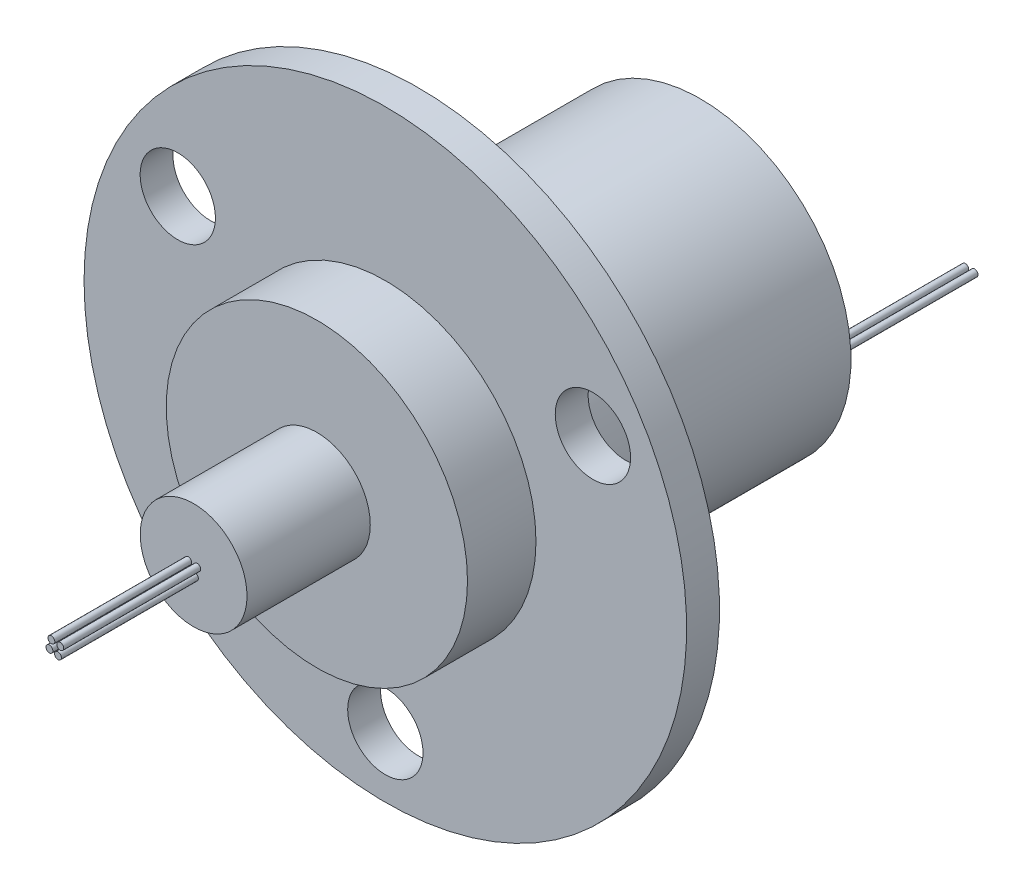
ISO-10303-21;
HEADER;
FILE_DESCRIPTION(('STEP AP214'),'2;1');
FILE_NAME('part.step','',(''),(''),'','','');
FILE_SCHEMA(('AUTOMOTIVE_DESIGN { 1 0 10303 214 1 1 1 1 }'));
ENDSEC;
DATA;
#1=APPLICATION_CONTEXT('core data for automotive mechanical design processes');
#2=APPLICATION_PROTOCOL_DEFINITION('international standard','automotive_design',2000,#1);
#3=PRODUCT_CONTEXT('',#1,'mechanical');
#4=PRODUCT('Part','Part','',(#3));
#5=PRODUCT_RELATED_PRODUCT_CATEGORY('part','',(#4));
#6=PRODUCT_DEFINITION_FORMATION('','',#4);
#7=PRODUCT_DEFINITION_CONTEXT('part definition',#1,'design');
#8=PRODUCT_DEFINITION('design','',#6,#7);
#9=PRODUCT_DEFINITION_SHAPE('','',#8);
#10=(LENGTH_UNIT() NAMED_UNIT(*) SI_UNIT(.MILLI.,.METRE.));
#11=(NAMED_UNIT(*) PLANE_ANGLE_UNIT() SI_UNIT($,.RADIAN.));
#12=(NAMED_UNIT(*) SI_UNIT($,.STERADIAN.) SOLID_ANGLE_UNIT());
#13=UNCERTAINTY_MEASURE_WITH_UNIT(LENGTH_MEASURE(1.E-05),#10,'distance_accuracy_value','');
#14=(GEOMETRIC_REPRESENTATION_CONTEXT(3) GLOBAL_UNCERTAINTY_ASSIGNED_CONTEXT((#13)) GLOBAL_UNIT_ASSIGNED_CONTEXT((#10,
#11,#12)) REPRESENTATION_CONTEXT('',''));
#15=CARTESIAN_POINT('',(0.,0.,0.));
#16=DIRECTION('',(0.,0.,1.));
#17=DIRECTION('',(1.,0.,0.));
#18=AXIS2_PLACEMENT_3D('',#15,#16,#17);
#19=CARTESIAN_POINT('',(0.,0.,0.));
#20=DIRECTION('',(0.,0.,-1.));
#21=DIRECTION('',(-1.,0.,0.));
#22=AXIS2_PLACEMENT_3D('',#19,#20,#21);
#23=PLANE('',#22);
#24=CARTESIAN_POINT('',(15.1554445662278,8.74999999999986,0.));
#25=DIRECTION('',(0.,0.,-1.));
#26=DIRECTION('',(-1.,0.,0.));
#27=AXIS2_PLACEMENT_3D('',#24,#25,#26);
#28=CIRCLE('',#27,2.74999999999998);
#29=CARTESIAN_POINT('',(12.4054445662278,8.74999999999986,0.));
#30=VERTEX_POINT('',#29);
#31=EDGE_CURVE('E66',#30,#30,#28,.T.);
#32=ORIENTED_EDGE('',*,*,#31,.F.);
#33=EDGE_LOOP('',(#32));
#34=FACE_BOUND('',#33,.T.);
#35=CARTESIAN_POINT('',(-15.1554445662276,8.75000000000007,0.));
#36=DIRECTION('',(0.,0.,-1.));
#37=DIRECTION('',(-1.,0.,0.));
#38=AXIS2_PLACEMENT_3D('',#35,#36,#37);
#39=CIRCLE('',#38,2.74999999999998);
#40=CARTESIAN_POINT('',(-17.9054445662276,8.75000000000007,0.));
#41=VERTEX_POINT('',#40);
#42=EDGE_CURVE('E56',#41,#41,#39,.T.);
#43=ORIENTED_EDGE('',*,*,#42,.F.);
#44=EDGE_LOOP('',(#43));
#45=FACE_BOUND('',#44,.T.);
#46=CARTESIAN_POINT('',(0.,-17.5,0.));
#47=DIRECTION('',(0.,0.,-1.));
#48=DIRECTION('',(-1.,0.,0.));
#49=AXIS2_PLACEMENT_3D('',#46,#47,#48);
#50=CIRCLE('',#49,2.74999999999998);
#51=CARTESIAN_POINT('',(-2.74999999999998,-17.5,0.));
#52=VERTEX_POINT('',#51);
#53=EDGE_CURVE('E53',#52,#52,#50,.T.);
#54=ORIENTED_EDGE('',*,*,#53,.F.);
#55=EDGE_LOOP('',(#54));
#56=FACE_BOUND('',#55,.T.);
#57=CARTESIAN_POINT('',(0.,0.,0.));
#58=DIRECTION('',(0.,0.,-1.));
#59=DIRECTION('',(-1.,0.,0.));
#60=AXIS2_PLACEMENT_3D('',#57,#58,#59);
#61=CIRCLE('',#60,22.);
#62=CARTESIAN_POINT('',(-22.,0.,0.));
#63=VERTEX_POINT('',#62);
#64=EDGE_CURVE('E108',#63,#63,#61,.T.);
#65=ORIENTED_EDGE('',*,*,#64,.T.);
#66=EDGE_LOOP('',(#65));
#67=FACE_BOUND('',#66,.T.);
#68=CARTESIAN_POINT('',(0.,0.,0.));
#69=DIRECTION('',(0.,0.,-1.));
#70=DIRECTION('',(-1.,0.,0.));
#71=AXIS2_PLACEMENT_3D('',#68,#69,#70);
#72=CIRCLE('',#71,11.);
#73=CARTESIAN_POINT('',(-11.,0.,0.));
#74=VERTEX_POINT('',#73);
#75=EDGE_CURVE('E92',#74,#74,#72,.T.);
#76=ORIENTED_EDGE('',*,*,#75,.F.);
#77=EDGE_LOOP('',(#76));
#78=FACE_BOUND('',#77,.T.);
#79=ADVANCED_FACE('F33',(#34,#45,#56,#67,#78),#23,.T.);
#80=CARTESIAN_POINT('',(0.,0.,7.4));
#81=DIRECTION('',(0.,0.,1.));
#82=DIRECTION('',(1.,0.,0.));
#83=AXIS2_PLACEMENT_3D('',#80,#81,#82);
#84=PLANE('',#83);
#85=CARTESIAN_POINT('',(0.,0.,7.4));
#86=DIRECTION('',(0.,0.,1.));
#87=DIRECTION('',(1.,0.,0.));
#88=AXIS2_PLACEMENT_3D('',#85,#86,#87);
#89=CIRCLE('',#88,11.);
#90=CARTESIAN_POINT('',(11.,0.,7.4));
#91=VERTEX_POINT('',#90);
#92=EDGE_CURVE('E105',#91,#91,#89,.T.);
#93=ORIENTED_EDGE('',*,*,#92,.T.);
#94=EDGE_LOOP('',(#93));
#95=FACE_BOUND('',#94,.T.);
#96=CARTESIAN_POINT('',(0.,0.,7.4));
#97=DIRECTION('',(0.,0.,1.));
#98=DIRECTION('',(1.,0.,0.));
#99=AXIS2_PLACEMENT_3D('',#96,#97,#98);
#100=CIRCLE('',#99,3.9);
#101=CARTESIAN_POINT('',(3.9,0.,7.4));
#102=VERTEX_POINT('',#101);
#103=EDGE_CURVE('E96',#102,#102,#100,.T.);
#104=ORIENTED_EDGE('',*,*,#103,.F.);
#105=EDGE_LOOP('',(#104));
#106=FACE_BOUND('',#105,.T.);
#107=ADVANCED_FACE('F155',(#95,#106),#84,.T.);
#108=CARTESIAN_POINT('',(22.,0.,2.4));
#109=DIRECTION('',(0.,0.,1.));
#110=DIRECTION('',(1.,0.,0.));
#111=AXIS2_PLACEMENT_3D('',#108,#109,#110);
#112=PLANE('',#111);
#113=CARTESIAN_POINT('',(15.1554445662278,8.74999999999986,2.4));
#114=DIRECTION('',(0.,0.,1.));
#115=DIRECTION('',(1.,0.,0.));
#116=AXIS2_PLACEMENT_3D('',#113,#114,#115);
#117=CIRCLE('',#116,2.74999999999998);
#118=CARTESIAN_POINT('',(17.9054445662277,8.74999999999986,2.4));
#119=VERTEX_POINT('',#118);
#120=EDGE_CURVE('E37',#119,#119,#117,.T.);
#121=ORIENTED_EDGE('',*,*,#120,.F.);
#122=EDGE_LOOP('',(#121));
#123=FACE_BOUND('',#122,.T.);
#124=CARTESIAN_POINT('',(-15.1554445662276,8.75000000000007,2.4));
#125=DIRECTION('',(0.,0.,1.));
#126=DIRECTION('',(1.,0.,0.));
#127=AXIS2_PLACEMENT_3D('',#124,#125,#126);
#128=CIRCLE('',#127,2.74999999999998);
#129=CARTESIAN_POINT('',(-12.4054445662277,8.75000000000007,2.4));
#130=VERTEX_POINT('',#129);
#131=EDGE_CURVE('E54',#130,#130,#128,.T.);
#132=ORIENTED_EDGE('',*,*,#131,.F.);
#133=EDGE_LOOP('',(#132));
#134=FACE_BOUND('',#133,.T.);
#135=CARTESIAN_POINT('',(0.,-17.5,2.4));
#136=DIRECTION('',(0.,0.,1.));
#137=DIRECTION('',(1.,0.,0.));
#138=AXIS2_PLACEMENT_3D('',#135,#136,#137);
#139=CIRCLE('',#138,2.74999999999998);
#140=CARTESIAN_POINT('',(2.74999999999998,-17.5,2.4));
#141=VERTEX_POINT('',#140);
#142=EDGE_CURVE('E50',#141,#141,#139,.T.);
#143=ORIENTED_EDGE('',*,*,#142,.F.);
#144=EDGE_LOOP('',(#143));
#145=FACE_BOUND('',#144,.T.);
#146=CARTESIAN_POINT('',(0.,0.,2.4));
#147=DIRECTION('',(0.,0.,-1.));
#148=DIRECTION('',(-1.,0.,0.));
#149=AXIS2_PLACEMENT_3D('',#146,#147,#148);
#150=CIRCLE('',#149,22.);
#151=CARTESIAN_POINT('',(-22.,0.,2.4));
#152=VERTEX_POINT('',#151);
#153=EDGE_CURVE('E113',#152,#152,#150,.T.);
#154=ORIENTED_EDGE('',*,*,#153,.F.);
#155=EDGE_LOOP('',(#154));
#156=FACE_BOUND('',#155,.T.);
#157=CARTESIAN_POINT('',(0.,0.,2.4));
#158=DIRECTION('',(0.,0.,1.));
#159=DIRECTION('',(1.,0.,0.));
#160=AXIS2_PLACEMENT_3D('',#157,#158,#159);
#161=CIRCLE('',#160,11.);
#162=CARTESIAN_POINT('',(11.,0.,2.4));
#163=VERTEX_POINT('',#162);
#164=EDGE_CURVE('E102',#163,#163,#161,.T.);
#165=ORIENTED_EDGE('',*,*,#164,.F.);
#166=EDGE_LOOP('',(#165));
#167=FACE_BOUND('',#166,.T.);
#168=ADVANCED_FACE('F161',(#123,#134,#145,#156,#167),#112,.T.);
#169=CARTESIAN_POINT('',(0.,0.,2.4));
#170=DIRECTION('',(0.,0.,-1.));
#171=DIRECTION('',(-1.,0.,0.));
#172=AXIS2_PLACEMENT_3D('',#169,#170,#171);
#173=CYLINDRICAL_SURFACE('',#172,22.);
#174=ORIENTED_EDGE('',*,*,#153,.T.);
#175=EDGE_LOOP('',(#174));
#176=FACE_BOUND('',#175,.T.);
#177=ORIENTED_EDGE('',*,*,#64,.F.);
#178=EDGE_LOOP('',(#177));
#179=FACE_BOUND('',#178,.T.);
#180=ADVANCED_FACE('F35',(#176,#179),#173,.T.);
#181=CARTESIAN_POINT('',(0.,0.,7.4));
#182=DIRECTION('',(0.,0.,-1.));
#183=DIRECTION('',(-1.,0.,0.));
#184=AXIS2_PLACEMENT_3D('',#181,#182,#183);
#185=CYLINDRICAL_SURFACE('',#184,11.);
#186=ORIENTED_EDGE('',*,*,#92,.F.);
#187=EDGE_LOOP('',(#186));
#188=FACE_BOUND('',#187,.T.);
#189=ORIENTED_EDGE('',*,*,#164,.T.);
#190=EDGE_LOOP('',(#189));
#191=FACE_BOUND('',#190,.T.);
#192=ADVANCED_FACE('F167',(#188,#191),#185,.T.);
#193=CARTESIAN_POINT('',(0.,0.,16.4));
#194=DIRECTION('',(0.,0.,-1.));
#195=DIRECTION('',(-1.,0.,0.));
#196=AXIS2_PLACEMENT_3D('',#193,#194,#195);
#197=CYLINDRICAL_SURFACE('',#196,3.9);
#198=CARTESIAN_POINT('',(0.,0.,16.4));
#199=DIRECTION('',(0.,0.,1.));
#200=DIRECTION('',(1.,0.,0.));
#201=AXIS2_PLACEMENT_3D('',#198,#199,#200);
#202=CIRCLE('',#201,3.9);
#203=CARTESIAN_POINT('',(3.9,0.,16.4));
#204=VERTEX_POINT('',#203);
#205=EDGE_CURVE('E99',#204,#204,#202,.T.);
#206=ORIENTED_EDGE('',*,*,#205,.F.);
#207=EDGE_LOOP('',(#206));
#208=FACE_BOUND('',#207,.T.);
#209=ORIENTED_EDGE('',*,*,#103,.T.);
#210=EDGE_LOOP('',(#209));
#211=FACE_BOUND('',#210,.T.);
#212=ADVANCED_FACE('F184',(#208,#211),#197,.T.);
#213=CARTESIAN_POINT('',(0.,0.,16.4));
#214=DIRECTION('',(0.,0.,1.));
#215=DIRECTION('',(1.,0.,0.));
#216=AXIS2_PLACEMENT_3D('',#213,#214,#215);
#217=PLANE('',#216);
#218=CARTESIAN_POINT('',(0.263776295341245,0.,16.4));
#219=DIRECTION('',(0.,0.,1.));
#220=DIRECTION('',(1.,0.,0.));
#221=AXIS2_PLACEMENT_3D('',#218,#219,#220);
#222=CIRCLE('',#221,0.25);
#223=CARTESIAN_POINT('',(0.513776295341245,0.,16.4));
#224=VERTEX_POINT('',#223);
#225=EDGE_CURVE('E10',#224,#224,#222,.T.);
#226=ORIENTED_EDGE('',*,*,#225,.F.);
#227=EDGE_LOOP('',(#226));
#228=FACE_BOUND('',#227,.T.);
#229=CARTESIAN_POINT('',(-0.527355811641428,-0.562471216596805,16.4));
#230=DIRECTION('',(0.,0.,1.));
#231=DIRECTION('',(1.,0.,0.));
#232=AXIS2_PLACEMENT_3D('',#229,#230,#231);
#233=CIRCLE('',#232,0.25);
#234=CARTESIAN_POINT('',(-0.277355811641428,-0.562471216596805,16.4));
#235=VERTEX_POINT('',#234);
#236=EDGE_CURVE('E122',#235,#235,#233,.T.);
#237=ORIENTED_EDGE('',*,*,#236,.F.);
#238=EDGE_LOOP('',(#237));
#239=FACE_BOUND('',#238,.T.);
#240=CARTESIAN_POINT('',(-0.38516931155641,0.0911610825937714,16.4));
#241=DIRECTION('',(0.,0.,1.));
#242=DIRECTION('',(1.,0.,0.));
#243=AXIS2_PLACEMENT_3D('',#240,#241,#242);
#244=CIRCLE('',#243,0.25);
#245=CARTESIAN_POINT('',(-0.13516931155641,0.0911610825937714,16.4));
#246=VERTEX_POINT('',#245);
#247=EDGE_CURVE('E119',#246,#246,#244,.T.);
#248=ORIENTED_EDGE('',*,*,#247,.F.);
#249=EDGE_LOOP('',(#248));
#250=FACE_BOUND('',#249,.T.);
#251=CARTESIAN_POINT('',(0.0981194299924937,-0.675788748253581,16.4));
#252=DIRECTION('',(0.,0.,1.));
#253=DIRECTION('',(1.,0.,0.));
#254=AXIS2_PLACEMENT_3D('',#251,#252,#253);
#255=CIRCLE('',#254,0.25);
#256=CARTESIAN_POINT('',(0.348119429992494,-0.675788748253581,16.4));
#257=VERTEX_POINT('',#256);
#258=EDGE_CURVE('E116',#257,#257,#255,.T.);
#259=ORIENTED_EDGE('',*,*,#258,.F.);
#260=EDGE_LOOP('',(#259));
#261=FACE_BOUND('',#260,.T.);
#262=ORIENTED_EDGE('',*,*,#205,.T.);
#263=EDGE_LOOP('',(#262));
#264=FACE_BOUND('',#263,.T.);
#265=ADVANCED_FACE('F150',(#228,#239,#250,#261,#264),#217,.T.);
#266=CARTESIAN_POINT('',(0.,0.,-20.6));
#267=DIRECTION('',(0.,0.,1.));
#268=DIRECTION('',(1.,0.,0.));
#269=AXIS2_PLACEMENT_3D('',#266,#267,#268);
#270=CYLINDRICAL_SURFACE('',#269,11.);
#271=CARTESIAN_POINT('',(0.,0.,-20.6));
#272=DIRECTION('',(0.,0.,-1.));
#273=DIRECTION('',(-1.,0.,0.));
#274=AXIS2_PLACEMENT_3D('',#271,#272,#273);
#275=CIRCLE('',#274,11.);
#276=CARTESIAN_POINT('',(-11.,0.,-20.6));
#277=VERTEX_POINT('',#276);
#278=EDGE_CURVE('E93',#277,#277,#275,.T.);
#279=ORIENTED_EDGE('',*,*,#278,.F.);
#280=EDGE_LOOP('',(#279));
#281=FACE_BOUND('',#280,.T.);
#282=ORIENTED_EDGE('',*,*,#75,.T.);
#283=EDGE_LOOP('',(#282));
#284=FACE_BOUND('',#283,.T.);
#285=ADVANCED_FACE('F139',(#281,#284),#270,.T.);
#286=CARTESIAN_POINT('',(0.,0.,-20.6));
#287=DIRECTION('',(0.,0.,-1.));
#288=DIRECTION('',(-1.,0.,0.));
#289=AXIS2_PLACEMENT_3D('',#286,#287,#288);
#290=PLANE('',#289);
#291=CARTESIAN_POINT('',(-10.102336314438,0.,-20.6));
#292=DIRECTION('',(0.,0.,-1.));
#293=DIRECTION('',(-1.,0.,0.));
#294=AXIS2_PLACEMENT_3D('',#291,#292,#293);
#295=CIRCLE('',#294,0.25);
#296=CARTESIAN_POINT('',(-10.352336314438,0.,-20.6));
#297=VERTEX_POINT('',#296);
#298=EDGE_CURVE('E41',#297,#297,#295,.T.);
#299=ORIENTED_EDGE('',*,*,#298,.F.);
#300=EDGE_LOOP('',(#299));
#301=FACE_BOUND('',#300,.T.);
#302=CARTESIAN_POINT('',(9.34429353671362,0.,-20.6));
#303=DIRECTION('',(0.,0.,-1.));
#304=DIRECTION('',(-1.,0.,0.));
#305=AXIS2_PLACEMENT_3D('',#302,#303,#304);
#306=CIRCLE('',#305,0.25);
#307=CARTESIAN_POINT('',(9.09429353671362,0.,-20.6));
#308=VERTEX_POINT('',#307);
#309=EDGE_CURVE('E46',#308,#308,#306,.T.);
#310=ORIENTED_EDGE('',*,*,#309,.F.);
#311=EDGE_LOOP('',(#310));
#312=FACE_BOUND('',#311,.T.);
#313=CARTESIAN_POINT('',(10.0241698032389,0.,-20.6));
#314=DIRECTION('',(0.,0.,-1.));
#315=DIRECTION('',(-1.,0.,0.));
#316=AXIS2_PLACEMENT_3D('',#313,#314,#315);
#317=CIRCLE('',#316,0.25);
#318=CARTESIAN_POINT('',(9.77416980323892,0.,-20.6));
#319=VERTEX_POINT('',#318);
#320=EDGE_CURVE('E128',#319,#319,#317,.T.);
#321=ORIENTED_EDGE('',*,*,#320,.F.);
#322=EDGE_LOOP('',(#321));
#323=FACE_BOUND('',#322,.T.);
#324=CARTESIAN_POINT('',(-9.26391296849852,0.,-20.6));
#325=DIRECTION('',(0.,0.,-1.));
#326=DIRECTION('',(-1.,0.,0.));
#327=AXIS2_PLACEMENT_3D('',#324,#325,#326);
#328=CIRCLE('',#327,0.25);
#329=CARTESIAN_POINT('',(-9.51391296849852,0.,-20.6));
#330=VERTEX_POINT('',#329);
#331=EDGE_CURVE('E125',#330,#330,#328,.T.);
#332=ORIENTED_EDGE('',*,*,#331,.F.);
#333=EDGE_LOOP('',(#332));
#334=FACE_BOUND('',#333,.T.);
#335=ORIENTED_EDGE('',*,*,#278,.T.);
#336=EDGE_LOOP('',(#335));
#337=FACE_BOUND('',#336,.T.);
#338=ADVANCED_FACE('F135',(#301,#312,#323,#334,#337),#290,.T.);
#339=CARTESIAN_POINT('',(0.0981194299924937,-0.675788748253581,26.4));
#340=DIRECTION('',(0.,0.,-1.));
#341=DIRECTION('',(-1.,0.,0.));
#342=AXIS2_PLACEMENT_3D('',#339,#340,#341);
#343=CYLINDRICAL_SURFACE('',#342,0.25);
#344=CARTESIAN_POINT('',(0.0981194299924937,-0.675788748253581,26.4));
#345=DIRECTION('',(0.,0.,-1.));
#346=DIRECTION('',(-1.,0.,0.));
#347=AXIS2_PLACEMENT_3D('',#344,#345,#346);
#348=CIRCLE('',#347,0.25);
#349=CARTESIAN_POINT('',(-0.151880570007506,-0.675788748253581,26.4));
#350=VERTEX_POINT('',#349);
#351=EDGE_CURVE('E89',#350,#350,#348,.T.);
#352=ORIENTED_EDGE('',*,*,#351,.T.);
#353=EDGE_LOOP('',(#352));
#354=FACE_BOUND('',#353,.T.);
#355=ORIENTED_EDGE('',*,*,#258,.T.);
#356=EDGE_LOOP('',(#355));
#357=FACE_BOUND('',#356,.T.);
#358=ADVANCED_FACE('F138',(#354,#357),#343,.T.);
#359=CARTESIAN_POINT('',(0.348119429992494,-0.675788748253581,26.4));
#360=DIRECTION('',(0.,0.,1.));
#361=DIRECTION('',(1.,0.,0.));
#362=AXIS2_PLACEMENT_3D('',#359,#360,#361);
#363=PLANE('',#362);
#364=ORIENTED_EDGE('',*,*,#351,.F.);
#365=EDGE_LOOP('',(#364));
#366=FACE_BOUND('',#365,.T.);
#367=ADVANCED_FACE('F204',(#366),#363,.T.);
#368=CARTESIAN_POINT('',(-0.38516931155641,0.0911610825937714,26.4));
#369=DIRECTION('',(0.,0.,-1.));
#370=DIRECTION('',(-1.,0.,0.));
#371=AXIS2_PLACEMENT_3D('',#368,#369,#370);
#372=CYLINDRICAL_SURFACE('',#371,0.25);
#373=CARTESIAN_POINT('',(-0.38516931155641,0.0911610825937714,26.4));
#374=DIRECTION('',(0.,0.,-1.));
#375=DIRECTION('',(-1.,0.,0.));
#376=AXIS2_PLACEMENT_3D('',#373,#374,#375);
#377=CIRCLE('',#376,0.25);
#378=CARTESIAN_POINT('',(-0.63516931155641,0.0911610825937714,26.4));
#379=VERTEX_POINT('',#378);
#380=EDGE_CURVE('E86',#379,#379,#377,.T.);
#381=ORIENTED_EDGE('',*,*,#380,.T.);
#382=EDGE_LOOP('',(#381));
#383=FACE_BOUND('',#382,.T.);
#384=ORIENTED_EDGE('',*,*,#247,.T.);
#385=EDGE_LOOP('',(#384));
#386=FACE_BOUND('',#385,.T.);
#387=ADVANCED_FACE('F208',(#383,#386),#372,.T.);
#388=CARTESIAN_POINT('',(-0.13516931155641,0.0911610825937714,26.4));
#389=DIRECTION('',(0.,0.,1.));
#390=DIRECTION('',(1.,0.,0.));
#391=AXIS2_PLACEMENT_3D('',#388,#389,#390);
#392=PLANE('',#391);
#393=ORIENTED_EDGE('',*,*,#380,.F.);
#394=EDGE_LOOP('',(#393));
#395=FACE_BOUND('',#394,.T.);
#396=ADVANCED_FACE('F212',(#395),#392,.T.);
#397=CARTESIAN_POINT('',(-0.527355811641428,-0.562471216596805,26.4));
#398=DIRECTION('',(0.,0.,-1.));
#399=DIRECTION('',(-1.,0.,0.));
#400=AXIS2_PLACEMENT_3D('',#397,#398,#399);
#401=CYLINDRICAL_SURFACE('',#400,0.25);
#402=CARTESIAN_POINT('',(-0.527355811641428,-0.562471216596805,26.4));
#403=DIRECTION('',(0.,0.,-1.));
#404=DIRECTION('',(-1.,0.,0.));
#405=AXIS2_PLACEMENT_3D('',#402,#403,#404);
#406=CIRCLE('',#405,0.25);
#407=CARTESIAN_POINT('',(-0.777355811641428,-0.562471216596805,26.4));
#408=VERTEX_POINT('',#407);
#409=EDGE_CURVE('E83',#408,#408,#406,.T.);
#410=ORIENTED_EDGE('',*,*,#409,.T.);
#411=EDGE_LOOP('',(#410));
#412=FACE_BOUND('',#411,.T.);
#413=ORIENTED_EDGE('',*,*,#236,.T.);
#414=EDGE_LOOP('',(#413));
#415=FACE_BOUND('',#414,.T.);
#416=ADVANCED_FACE('F216',(#412,#415),#401,.T.);
#417=CARTESIAN_POINT('',(-0.277355811641428,-0.562471216596805,26.4));
#418=DIRECTION('',(0.,0.,1.));
#419=DIRECTION('',(1.,0.,0.));
#420=AXIS2_PLACEMENT_3D('',#417,#418,#419);
#421=PLANE('',#420);
#422=ORIENTED_EDGE('',*,*,#409,.F.);
#423=EDGE_LOOP('',(#422));
#424=FACE_BOUND('',#423,.T.);
#425=ADVANCED_FACE('F220',(#424),#421,.T.);
#426=CARTESIAN_POINT('',(-9.26391296849852,0.,-30.6));
#427=DIRECTION('',(0.,0.,1.));
#428=DIRECTION('',(1.,0.,0.));
#429=AXIS2_PLACEMENT_3D('',#426,#427,#428);
#430=CYLINDRICAL_SURFACE('',#429,0.25);
#431=CARTESIAN_POINT('',(-9.26391296849852,0.,-30.6));
#432=DIRECTION('',(0.,0.,1.));
#433=DIRECTION('',(1.,0.,0.));
#434=AXIS2_PLACEMENT_3D('',#431,#432,#433);
#435=CIRCLE('',#434,0.25);
#436=CARTESIAN_POINT('',(-9.01391296849852,0.,-30.6));
#437=VERTEX_POINT('',#436);
#438=EDGE_CURVE('E80',#437,#437,#435,.T.);
#439=ORIENTED_EDGE('',*,*,#438,.T.);
#440=EDGE_LOOP('',(#439));
#441=FACE_BOUND('',#440,.T.);
#442=ORIENTED_EDGE('',*,*,#331,.T.);
#443=EDGE_LOOP('',(#442));
#444=FACE_BOUND('',#443,.T.);
#445=ADVANCED_FACE('F224',(#441,#444),#430,.T.);
#446=CARTESIAN_POINT('',(-9.01391296849852,0.,-30.6));
#447=DIRECTION('',(0.,0.,-1.));
#448=DIRECTION('',(-1.,0.,0.));
#449=AXIS2_PLACEMENT_3D('',#446,#447,#448);
#450=PLANE('',#449);
#451=ORIENTED_EDGE('',*,*,#438,.F.);
#452=EDGE_LOOP('',(#451));
#453=FACE_BOUND('',#452,.T.);
#454=ADVANCED_FACE('F228',(#453),#450,.T.);
#455=CARTESIAN_POINT('',(10.0241698032389,0.,-30.6));
#456=DIRECTION('',(0.,0.,1.));
#457=DIRECTION('',(1.,0.,0.));
#458=AXIS2_PLACEMENT_3D('',#455,#456,#457);
#459=CYLINDRICAL_SURFACE('',#458,0.25);
#460=CARTESIAN_POINT('',(10.0241698032389,0.,-30.6));
#461=DIRECTION('',(0.,0.,1.));
#462=DIRECTION('',(1.,0.,0.));
#463=AXIS2_PLACEMENT_3D('',#460,#461,#462);
#464=CIRCLE('',#463,0.25);
#465=CARTESIAN_POINT('',(10.2741698032389,0.,-30.6));
#466=VERTEX_POINT('',#465);
#467=EDGE_CURVE('E77',#466,#466,#464,.T.);
#468=ORIENTED_EDGE('',*,*,#467,.T.);
#469=EDGE_LOOP('',(#468));
#470=FACE_BOUND('',#469,.T.);
#471=ORIENTED_EDGE('',*,*,#320,.T.);
#472=EDGE_LOOP('',(#471));
#473=FACE_BOUND('',#472,.T.);
#474=ADVANCED_FACE('F232',(#470,#473),#459,.T.);
#475=CARTESIAN_POINT('',(10.2741698032389,0.,-30.6));
#476=DIRECTION('',(0.,0.,-1.));
#477=DIRECTION('',(-1.,0.,0.));
#478=AXIS2_PLACEMENT_3D('',#475,#476,#477);
#479=PLANE('',#478);
#480=ORIENTED_EDGE('',*,*,#467,.F.);
#481=EDGE_LOOP('',(#480));
#482=FACE_BOUND('',#481,.T.);
#483=ADVANCED_FACE('F236',(#482),#479,.T.);
#484=CARTESIAN_POINT('',(9.34429353671362,0.,-30.6));
#485=DIRECTION('',(0.,0.,1.));
#486=DIRECTION('',(1.,0.,0.));
#487=AXIS2_PLACEMENT_3D('',#484,#485,#486);
#488=CYLINDRICAL_SURFACE('',#487,0.25);
#489=CARTESIAN_POINT('',(9.34429353671362,0.,-30.6));
#490=DIRECTION('',(0.,0.,1.));
#491=DIRECTION('',(1.,0.,0.));
#492=AXIS2_PLACEMENT_3D('',#489,#490,#491);
#493=CIRCLE('',#492,0.25);
#494=CARTESIAN_POINT('',(9.59429353671362,0.,-30.6));
#495=VERTEX_POINT('',#494);
#496=EDGE_CURVE('E74',#495,#495,#493,.T.);
#497=ORIENTED_EDGE('',*,*,#496,.T.);
#498=EDGE_LOOP('',(#497));
#499=FACE_BOUND('',#498,.T.);
#500=ORIENTED_EDGE('',*,*,#309,.T.);
#501=EDGE_LOOP('',(#500));
#502=FACE_BOUND('',#501,.T.);
#503=ADVANCED_FACE('F133',(#499,#502),#488,.T.);
#504=CARTESIAN_POINT('',(9.59429353671362,0.,-30.6));
#505=DIRECTION('',(0.,0.,-1.));
#506=DIRECTION('',(-1.,0.,0.));
#507=AXIS2_PLACEMENT_3D('',#504,#505,#506);
#508=PLANE('',#507);
#509=ORIENTED_EDGE('',*,*,#496,.F.);
#510=EDGE_LOOP('',(#509));
#511=FACE_BOUND('',#510,.T.);
#512=ADVANCED_FACE('F243',(#511),#508,.T.);
#513=CARTESIAN_POINT('',(-10.102336314438,0.,-30.6));
#514=DIRECTION('',(0.,0.,1.));
#515=DIRECTION('',(1.,0.,0.));
#516=AXIS2_PLACEMENT_3D('',#513,#514,#515);
#517=CYLINDRICAL_SURFACE('',#516,0.25);
#518=CARTESIAN_POINT('',(-10.102336314438,0.,-30.6));
#519=DIRECTION('',(0.,0.,1.));
#520=DIRECTION('',(1.,0.,0.));
#521=AXIS2_PLACEMENT_3D('',#518,#519,#520);
#522=CIRCLE('',#521,0.25);
#523=CARTESIAN_POINT('',(-9.85233631443805,0.,-30.6));
#524=VERTEX_POINT('',#523);
#525=EDGE_CURVE('E71',#524,#524,#522,.T.);
#526=ORIENTED_EDGE('',*,*,#525,.T.);
#527=EDGE_LOOP('',(#526));
#528=FACE_BOUND('',#527,.T.);
#529=ORIENTED_EDGE('',*,*,#298,.T.);
#530=EDGE_LOOP('',(#529));
#531=FACE_BOUND('',#530,.T.);
#532=ADVANCED_FACE('F247',(#528,#531),#517,.T.);
#533=CARTESIAN_POINT('',(-9.85233631443805,0.,-30.6));
#534=DIRECTION('',(0.,0.,-1.));
#535=DIRECTION('',(-1.,0.,0.));
#536=AXIS2_PLACEMENT_3D('',#533,#534,#535);
#537=PLANE('',#536);
#538=ORIENTED_EDGE('',*,*,#525,.F.);
#539=EDGE_LOOP('',(#538));
#540=FACE_BOUND('',#539,.T.);
#541=ADVANCED_FACE('F251',(#540),#537,.T.);
#542=CARTESIAN_POINT('',(0.263776295341245,0.,26.4));
#543=DIRECTION('',(0.,0.,-1.));
#544=DIRECTION('',(-1.,0.,0.));
#545=AXIS2_PLACEMENT_3D('',#542,#543,#544);
#546=CYLINDRICAL_SURFACE('',#545,0.25);
#547=CARTESIAN_POINT('',(0.263776295341245,0.,26.4));
#548=DIRECTION('',(0.,0.,-1.));
#549=DIRECTION('',(-1.,0.,0.));
#550=AXIS2_PLACEMENT_3D('',#547,#548,#549);
#551=CIRCLE('',#550,0.25);
#552=CARTESIAN_POINT('',(0.0137762953412448,0.,26.4));
#553=VERTEX_POINT('',#552);
#554=EDGE_CURVE('E52',#553,#553,#551,.T.);
#555=ORIENTED_EDGE('',*,*,#554,.T.);
#556=EDGE_LOOP('',(#555));
#557=FACE_BOUND('',#556,.T.);
#558=ORIENTED_EDGE('',*,*,#225,.T.);
#559=EDGE_LOOP('',(#558));
#560=FACE_BOUND('',#559,.T.);
#561=ADVANCED_FACE('F255',(#557,#560),#546,.T.);
#562=CARTESIAN_POINT('',(0.513776295341245,0.,26.4));
#563=DIRECTION('',(0.,0.,1.));
#564=DIRECTION('',(1.,0.,0.));
#565=AXIS2_PLACEMENT_3D('',#562,#563,#564);
#566=PLANE('',#565);
#567=ORIENTED_EDGE('',*,*,#554,.F.);
#568=EDGE_LOOP('',(#567));
#569=FACE_BOUND('',#568,.T.);
#570=ADVANCED_FACE('F259',(#569),#566,.T.);
#571=CARTESIAN_POINT('',(0.,-17.5,0.));
#572=DIRECTION('',(0.,0.,-1.));
#573=DIRECTION('',(-1.,0.,0.));
#574=AXIS2_PLACEMENT_3D('',#571,#572,#573);
#575=CYLINDRICAL_SURFACE('',#574,2.74999999999998);
#576=ORIENTED_EDGE('',*,*,#142,.T.);
#577=EDGE_LOOP('',(#576));
#578=FACE_BOUND('',#577,.T.);
#579=ORIENTED_EDGE('',*,*,#53,.T.);
#580=EDGE_LOOP('',(#579));
#581=FACE_BOUND('',#580,.T.);
#582=ADVANCED_FACE('F263',(#578,#581),#575,.F.);
#583=CARTESIAN_POINT('',(-15.1554445662276,8.75000000000007,0.));
#584=DIRECTION('',(0.,0.,-1.));
#585=DIRECTION('',(-1.,0.,0.));
#586=AXIS2_PLACEMENT_3D('',#583,#584,#585);
#587=CYLINDRICAL_SURFACE('',#586,2.74999999999998);
#588=ORIENTED_EDGE('',*,*,#131,.T.);
#589=EDGE_LOOP('',(#588));
#590=FACE_BOUND('',#589,.T.);
#591=ORIENTED_EDGE('',*,*,#42,.T.);
#592=EDGE_LOOP('',(#591));
#593=FACE_BOUND('',#592,.T.);
#594=ADVANCED_FACE('F267',(#590,#593),#587,.F.);
#595=CARTESIAN_POINT('',(15.1554445662278,8.74999999999986,0.));
#596=DIRECTION('',(0.,0.,-1.));
#597=DIRECTION('',(-1.,0.,0.));
#598=AXIS2_PLACEMENT_3D('',#595,#596,#597);
#599=CYLINDRICAL_SURFACE('',#598,2.74999999999998);
#600=ORIENTED_EDGE('',*,*,#120,.T.);
#601=EDGE_LOOP('',(#600));
#602=FACE_BOUND('',#601,.T.);
#603=ORIENTED_EDGE('',*,*,#31,.T.);
#604=EDGE_LOOP('',(#603));
#605=FACE_BOUND('',#604,.T.);
#606=ADVANCED_FACE('F271',(#602,#605),#599,.F.);
#607=CLOSED_SHELL('',(#79,#107,#168,#180,#192,#212,#265,#285,#338,#358,#367,#387,#396,#416,#425,
#445,#454,#474,#483,#503,#512,#532,#541,#561,#570,#582,#594,#606));
#608=MANIFOLD_SOLID_BREP('B2',#607);
#609=ADVANCED_BREP_SHAPE_REPRESENTATION('',(#18,#608),#14);
#610=SHAPE_DEFINITION_REPRESENTATION(#9,#609);
ENDSEC;
END-ISO-10303-21;
